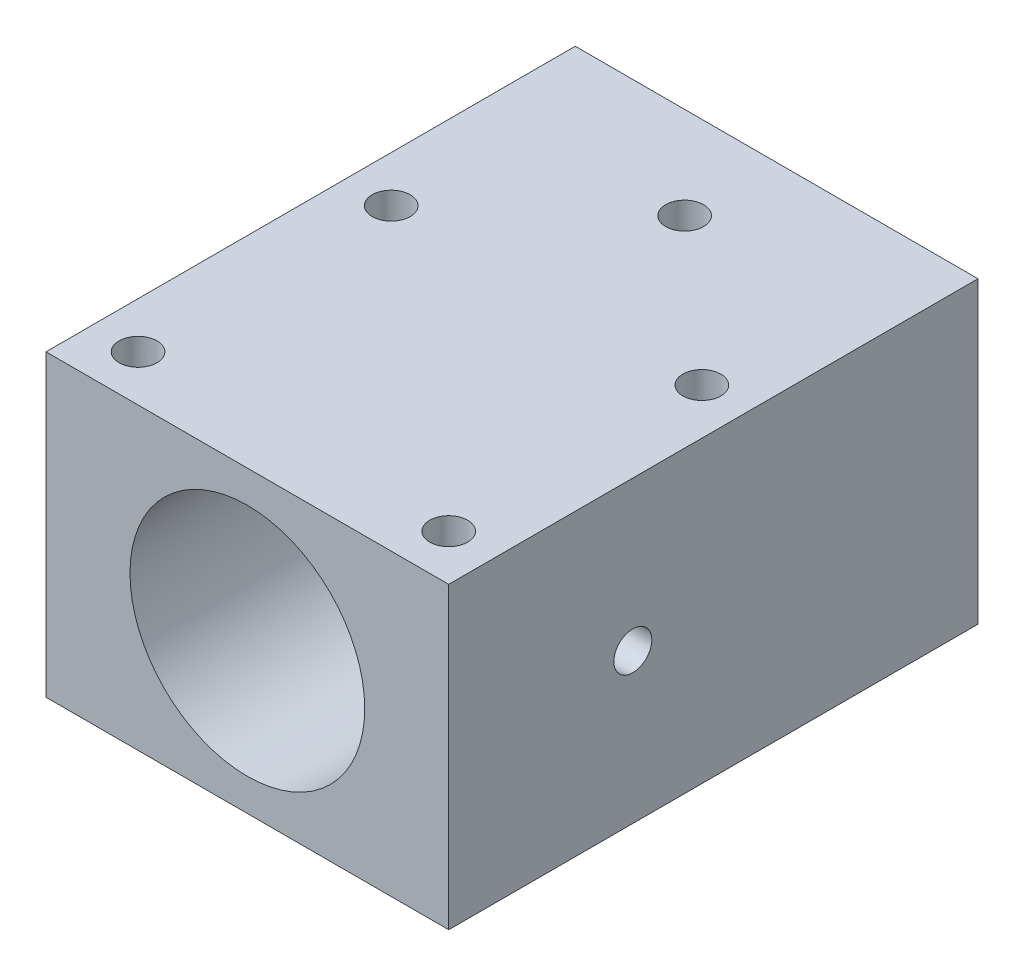
ISO-10303-21;
HEADER;
FILE_DESCRIPTION(('STEP AP214'),'2;1');
FILE_NAME('part.step','',(''),(''),'','','');
FILE_SCHEMA(('AUTOMOTIVE_DESIGN { 1 0 10303 214 1 1 1 1 }'));
ENDSEC;
DATA;
#1=APPLICATION_CONTEXT('core data for automotive mechanical design processes');
#2=APPLICATION_PROTOCOL_DEFINITION('international standard','automotive_design',2000,#1);
#3=PRODUCT_CONTEXT('',#1,'mechanical');
#4=PRODUCT('Part','Part','',(#3));
#5=PRODUCT_RELATED_PRODUCT_CATEGORY('part','',(#4));
#6=PRODUCT_DEFINITION_FORMATION('','',#4);
#7=PRODUCT_DEFINITION_CONTEXT('part definition',#1,'design');
#8=PRODUCT_DEFINITION('design','',#6,#7);
#9=PRODUCT_DEFINITION_SHAPE('','',#8);
#10=(LENGTH_UNIT() NAMED_UNIT(*) SI_UNIT(.MILLI.,.METRE.));
#11=(NAMED_UNIT(*) PLANE_ANGLE_UNIT() SI_UNIT($,.RADIAN.));
#12=(NAMED_UNIT(*) SI_UNIT($,.STERADIAN.) SOLID_ANGLE_UNIT());
#13=UNCERTAINTY_MEASURE_WITH_UNIT(LENGTH_MEASURE(1.E-05),#10,'distance_accuracy_value','');
#14=(GEOMETRIC_REPRESENTATION_CONTEXT(3) GLOBAL_UNCERTAINTY_ASSIGNED_CONTEXT((#13)) GLOBAL_UNIT_ASSIGNED_CONTEXT((#10,
#11,#12)) REPRESENTATION_CONTEXT('',''));
#15=CARTESIAN_POINT('',(0.,0.,0.));
#16=DIRECTION('',(0.,0.,1.));
#17=DIRECTION('',(1.,0.,0.));
#18=AXIS2_PLACEMENT_3D('',#15,#16,#17);
#19=CARTESIAN_POINT('',(17.5,13.,23.));
#20=DIRECTION('',(-1.,0.,0.));
#21=DIRECTION('',(0.,0.,1.));
#22=AXIS2_PLACEMENT_3D('',#19,#20,#21);
#23=PLANE('',#22);
#24=CARTESIAN_POINT('',(17.5,0.,7.));
#25=DIRECTION('',(-1.,0.,0.));
#26=DIRECTION('',(0.,0.,1.));
#27=AXIS2_PLACEMENT_3D('',#24,#25,#26);
#28=CIRCLE('',#27,1.65);
#29=CARTESIAN_POINT('',(17.5,0.,8.65));
#30=VERTEX_POINT('',#29);
#31=EDGE_CURVE('E148',#30,#30,#28,.F.);
#32=ORIENTED_EDGE('',*,*,#31,.F.);
#33=EDGE_LOOP('',(#32));
#34=FACE_BOUND('',#33,.T.);
#35=DIRECTION('',(0.,0.,-1.));
#36=VECTOR('',#35,1.);
#37=CARTESIAN_POINT('',(17.5,-13.,23.));
#38=LINE('',#37,#36);
#39=CARTESIAN_POINT('',(17.5,-13.,23.));
#40=VERTEX_POINT('',#39);
#41=CARTESIAN_POINT('',(17.5,-13.,-23.));
#42=VERTEX_POINT('',#41);
#43=EDGE_CURVE('E107',#40,#42,#38,.T.);
#44=ORIENTED_EDGE('',*,*,#43,.T.);
#45=DIRECTION('',(0.,-1.,0.));
#46=VECTOR('',#45,1.);
#47=CARTESIAN_POINT('',(17.5,13.,-23.));
#48=LINE('',#47,#46);
#49=CARTESIAN_POINT('',(17.5,13.,-23.));
#50=VERTEX_POINT('',#49);
#51=EDGE_CURVE('E11',#50,#42,#48,.T.);
#52=ORIENTED_EDGE('',*,*,#51,.F.);
#53=DIRECTION('',(0.,0.,-1.));
#54=VECTOR('',#53,1.);
#55=CARTESIAN_POINT('',(17.5,13.,23.));
#56=LINE('',#55,#54);
#57=CARTESIAN_POINT('',(17.5,13.,23.));
#58=VERTEX_POINT('',#57);
#59=EDGE_CURVE('E94',#58,#50,#56,.T.);
#60=ORIENTED_EDGE('',*,*,#59,.F.);
#61=DIRECTION('',(0.,-1.,0.));
#62=VECTOR('',#61,1.);
#63=CARTESIAN_POINT('',(17.5,13.,23.));
#64=LINE('',#63,#62);
#65=EDGE_CURVE('E103',#58,#40,#64,.T.);
#66=ORIENTED_EDGE('',*,*,#65,.T.);
#67=EDGE_LOOP('',(#44,#52,#60,#66));
#68=FACE_BOUND('',#67,.T.);
#69=ADVANCED_FACE('F36',(#34,#68),#23,.F.);
#70=CARTESIAN_POINT('',(-17.5,13.,-23.));
#71=DIRECTION('',(0.,0.,1.));
#72=DIRECTION('',(1.,0.,0.));
#73=AXIS2_PLACEMENT_3D('',#70,#71,#72);
#74=PLANE('',#73);
#75=CARTESIAN_POINT('',(0.,0.,-23.));
#76=DIRECTION('',(0.,0.,1.));
#77=DIRECTION('',(1.,0.,0.));
#78=AXIS2_PLACEMENT_3D('',#75,#76,#77);
#79=CIRCLE('',#78,10.2);
#80=CARTESIAN_POINT('',(10.2,0.,-23.));
#81=VERTEX_POINT('',#80);
#82=EDGE_CURVE('E167',#81,#81,#79,.F.);
#83=ORIENTED_EDGE('',*,*,#82,.F.);
#84=EDGE_LOOP('',(#83));
#85=FACE_BOUND('',#84,.T.);
#86=DIRECTION('',(-1.,0.,0.));
#87=VECTOR('',#86,1.);
#88=CARTESIAN_POINT('',(-17.5,-13.,-23.));
#89=LINE('',#88,#87);
#90=CARTESIAN_POINT('',(-17.5,-13.,-23.));
#91=VERTEX_POINT('',#90);
#92=EDGE_CURVE('E98',#42,#91,#89,.T.);
#93=ORIENTED_EDGE('',*,*,#92,.T.);
#94=DIRECTION('',(0.,-1.,0.));
#95=VECTOR('',#94,1.);
#96=CARTESIAN_POINT('',(-17.5,13.,-23.));
#97=LINE('',#96,#95);
#98=CARTESIAN_POINT('',(-17.5,13.,-23.));
#99=VERTEX_POINT('',#98);
#100=EDGE_CURVE('E50',#99,#91,#97,.T.);
#101=ORIENTED_EDGE('',*,*,#100,.F.);
#102=DIRECTION('',(-1.,0.,0.));
#103=VECTOR('',#102,1.);
#104=CARTESIAN_POINT('',(-17.5,13.,-23.));
#105=LINE('',#104,#103);
#106=EDGE_CURVE('E89',#50,#99,#105,.T.);
#107=ORIENTED_EDGE('',*,*,#106,.F.);
#108=ORIENTED_EDGE('',*,*,#51,.T.);
#109=EDGE_LOOP('',(#93,#101,#107,#108));
#110=FACE_BOUND('',#109,.T.);
#111=ADVANCED_FACE('F97',(#85,#110),#74,.F.);
#112=CARTESIAN_POINT('',(-17.5,13.,23.));
#113=DIRECTION('',(1.,0.,0.));
#114=DIRECTION('',(0.,0.,-1.));
#115=AXIS2_PLACEMENT_3D('',#112,#113,#114);
#116=PLANE('',#115);
#117=CARTESIAN_POINT('',(-17.5,0.,7.));
#118=DIRECTION('',(-1.,0.,0.));
#119=DIRECTION('',(0.,0.,1.));
#120=AXIS2_PLACEMENT_3D('',#117,#118,#119);
#121=CIRCLE('',#120,1.65);
#122=CARTESIAN_POINT('',(-17.5,0.,8.65));
#123=VERTEX_POINT('',#122);
#124=EDGE_CURVE('E154',#123,#123,#121,.T.);
#125=ORIENTED_EDGE('',*,*,#124,.F.);
#126=EDGE_LOOP('',(#125));
#127=FACE_BOUND('',#126,.T.);
#128=DIRECTION('',(0.,0.,1.));
#129=VECTOR('',#128,1.);
#130=CARTESIAN_POINT('',(-17.5,-13.,23.));
#131=LINE('',#130,#129);
#132=CARTESIAN_POINT('',(-17.5,-13.,23.));
#133=VERTEX_POINT('',#132);
#134=EDGE_CURVE('E76',#91,#133,#131,.T.);
#135=ORIENTED_EDGE('',*,*,#134,.T.);
#136=DIRECTION('',(0.,-1.,0.));
#137=VECTOR('',#136,1.);
#138=CARTESIAN_POINT('',(-17.5,13.,23.));
#139=LINE('',#138,#137);
#140=CARTESIAN_POINT('',(-17.5,13.,23.));
#141=VERTEX_POINT('',#140);
#142=EDGE_CURVE('E99',#141,#133,#139,.T.);
#143=ORIENTED_EDGE('',*,*,#142,.F.);
#144=DIRECTION('',(0.,0.,1.));
#145=VECTOR('',#144,1.);
#146=CARTESIAN_POINT('',(-17.5,13.,23.));
#147=LINE('',#146,#145);
#148=EDGE_CURVE('E92',#99,#141,#147,.T.);
#149=ORIENTED_EDGE('',*,*,#148,.F.);
#150=ORIENTED_EDGE('',*,*,#100,.T.);
#151=EDGE_LOOP('',(#135,#143,#149,#150));
#152=FACE_BOUND('',#151,.T.);
#153=ADVANCED_FACE('F101',(#127,#152),#116,.F.);
#154=CARTESIAN_POINT('',(-17.5,13.,23.));
#155=DIRECTION('',(0.,0.,-1.));
#156=DIRECTION('',(-1.,0.,0.));
#157=AXIS2_PLACEMENT_3D('',#154,#155,#156);
#158=PLANE('',#157);
#159=CARTESIAN_POINT('',(0.,0.,23.));
#160=DIRECTION('',(0.,0.,1.));
#161=DIRECTION('',(1.,0.,0.));
#162=AXIS2_PLACEMENT_3D('',#159,#160,#161);
#163=CIRCLE('',#162,10.2);
#164=CARTESIAN_POINT('',(10.2,0.,23.));
#165=VERTEX_POINT('',#164);
#166=EDGE_CURVE('E164',#165,#165,#163,.T.);
#167=ORIENTED_EDGE('',*,*,#166,.F.);
#168=EDGE_LOOP('',(#167));
#169=FACE_BOUND('',#168,.T.);
#170=DIRECTION('',(1.,0.,0.));
#171=VECTOR('',#170,1.);
#172=CARTESIAN_POINT('',(-17.5,-13.,23.));
#173=LINE('',#172,#171);
#174=EDGE_CURVE('E82',#133,#40,#173,.T.);
#175=ORIENTED_EDGE('',*,*,#174,.T.);
#176=ORIENTED_EDGE('',*,*,#65,.F.);
#177=DIRECTION('',(1.,0.,0.));
#178=VECTOR('',#177,1.);
#179=CARTESIAN_POINT('',(-17.5,13.,23.));
#180=LINE('',#179,#178);
#181=EDGE_CURVE('E59',#141,#58,#180,.T.);
#182=ORIENTED_EDGE('',*,*,#181,.F.);
#183=ORIENTED_EDGE('',*,*,#142,.T.);
#184=EDGE_LOOP('',(#175,#176,#182,#183));
#185=FACE_BOUND('',#184,.T.);
#186=ADVANCED_FACE('F220',(#169,#185),#158,.F.);
#187=CARTESIAN_POINT('',(0.,13.,0.));
#188=DIRECTION('',(0.,-1.,0.));
#189=DIRECTION('',(0.,0.,-1.));
#190=AXIS2_PLACEMENT_3D('',#187,#188,#189);
#191=PLANE('',#190);
#192=CARTESIAN_POINT('',(0.,13.,-15.));
#193=DIRECTION('',(0.,1.,0.));
#194=DIRECTION('',(0.,0.,1.));
#195=AXIS2_PLACEMENT_3D('',#192,#193,#194);
#196=CIRCLE('',#195,1.65);
#197=CARTESIAN_POINT('',(0.,13.,-13.35));
#198=VERTEX_POINT('',#197);
#199=EDGE_CURVE('E152',#198,#198,#196,.T.);
#200=ORIENTED_EDGE('',*,*,#199,.F.);
#201=EDGE_LOOP('',(#200));
#202=FACE_BOUND('',#201,.T.);
#203=CARTESIAN_POINT('',(13.5,13.,-3.));
#204=DIRECTION('',(0.,1.,0.));
#205=DIRECTION('',(0.,0.,-1.));
#206=AXIS2_PLACEMENT_3D('',#203,#204,#205);
#207=CIRCLE('',#206,1.65);
#208=CARTESIAN_POINT('',(13.5,13.,-4.65));
#209=VERTEX_POINT('',#208);
#210=EDGE_CURVE('E170',#209,#209,#207,.T.);
#211=ORIENTED_EDGE('',*,*,#210,.F.);
#212=EDGE_LOOP('',(#211));
#213=FACE_BOUND('',#212,.T.);
#214=CARTESIAN_POINT('',(13.5,13.,19.));
#215=DIRECTION('',(0.,1.,0.));
#216=DIRECTION('',(0.,0.,-1.));
#217=AXIS2_PLACEMENT_3D('',#214,#215,#216);
#218=CIRCLE('',#217,1.65);
#219=CARTESIAN_POINT('',(13.5,13.,17.35));
#220=VERTEX_POINT('',#219);
#221=EDGE_CURVE('E179',#220,#220,#218,.T.);
#222=ORIENTED_EDGE('',*,*,#221,.F.);
#223=EDGE_LOOP('',(#222));
#224=FACE_BOUND('',#223,.T.);
#225=CARTESIAN_POINT('',(-13.5,13.,19.));
#226=DIRECTION('',(0.,1.,0.));
#227=DIRECTION('',(0.,0.,1.));
#228=AXIS2_PLACEMENT_3D('',#225,#226,#227);
#229=CIRCLE('',#228,1.65);
#230=CARTESIAN_POINT('',(-13.5,13.,20.65));
#231=VERTEX_POINT('',#230);
#232=EDGE_CURVE('E171',#231,#231,#229,.T.);
#233=ORIENTED_EDGE('',*,*,#232,.F.);
#234=EDGE_LOOP('',(#233));
#235=FACE_BOUND('',#234,.T.);
#236=CARTESIAN_POINT('',(-13.5,13.,-3.));
#237=DIRECTION('',(0.,1.,0.));
#238=DIRECTION('',(0.,0.,1.));
#239=AXIS2_PLACEMENT_3D('',#236,#237,#238);
#240=CIRCLE('',#239,1.65);
#241=CARTESIAN_POINT('',(-13.5,13.,-1.35));
#242=VERTEX_POINT('',#241);
#243=EDGE_CURVE('E178',#242,#242,#240,.T.);
#244=ORIENTED_EDGE('',*,*,#243,.F.);
#245=EDGE_LOOP('',(#244));
#246=FACE_BOUND('',#245,.T.);
#247=ORIENTED_EDGE('',*,*,#59,.T.);
#248=ORIENTED_EDGE('',*,*,#106,.T.);
#249=ORIENTED_EDGE('',*,*,#148,.T.);
#250=ORIENTED_EDGE('',*,*,#181,.T.);
#251=EDGE_LOOP('',(#247,#248,#249,#250));
#252=FACE_BOUND('',#251,.T.);
#253=ADVANCED_FACE('F90',(#202,#213,#224,#235,#246,#252),#191,.F.);
#254=CARTESIAN_POINT('',(0.,-13.,0.));
#255=DIRECTION('',(0.,-1.,0.));
#256=DIRECTION('',(0.,0.,-1.));
#257=AXIS2_PLACEMENT_3D('',#254,#255,#256);
#258=PLANE('',#257);
#259=CARTESIAN_POINT('',(0.,-13.,-15.));
#260=DIRECTION('',(0.,-1.,0.));
#261=DIRECTION('',(0.,0.,-1.));
#262=AXIS2_PLACEMENT_3D('',#259,#260,#261);
#263=CIRCLE('',#262,1.65);
#264=CARTESIAN_POINT('',(0.,-13.,-16.65));
#265=VERTEX_POINT('',#264);
#266=EDGE_CURVE('E124',#265,#265,#263,.F.);
#267=ORIENTED_EDGE('',*,*,#266,.T.);
#268=EDGE_LOOP('',(#267));
#269=FACE_BOUND('',#268,.T.);
#270=CARTESIAN_POINT('',(13.5,-13.,-3.));
#271=DIRECTION('',(0.,-1.,0.));
#272=DIRECTION('',(0.,0.,-1.));
#273=AXIS2_PLACEMENT_3D('',#270,#271,#272);
#274=CIRCLE('',#273,1.65);
#275=CARTESIAN_POINT('',(13.5,-13.,-4.65));
#276=VERTEX_POINT('',#275);
#277=EDGE_CURVE('E182',#276,#276,#274,.F.);
#278=ORIENTED_EDGE('',*,*,#277,.T.);
#279=EDGE_LOOP('',(#278));
#280=FACE_BOUND('',#279,.T.);
#281=CARTESIAN_POINT('',(13.5,-13.,19.));
#282=DIRECTION('',(0.,-1.,0.));
#283=DIRECTION('',(0.,0.,-1.));
#284=AXIS2_PLACEMENT_3D('',#281,#282,#283);
#285=CIRCLE('',#284,1.65);
#286=CARTESIAN_POINT('',(13.5,-13.,17.35));
#287=VERTEX_POINT('',#286);
#288=EDGE_CURVE('E175',#287,#287,#285,.F.);
#289=ORIENTED_EDGE('',*,*,#288,.T.);
#290=EDGE_LOOP('',(#289));
#291=FACE_BOUND('',#290,.T.);
#292=CARTESIAN_POINT('',(-13.5,-13.,19.));
#293=DIRECTION('',(0.,-1.,0.));
#294=DIRECTION('',(0.,0.,-1.));
#295=AXIS2_PLACEMENT_3D('',#292,#293,#294);
#296=CIRCLE('',#295,1.65);
#297=CARTESIAN_POINT('',(-13.5,-13.,17.35));
#298=VERTEX_POINT('',#297);
#299=EDGE_CURVE('E174',#298,#298,#296,.F.);
#300=ORIENTED_EDGE('',*,*,#299,.T.);
#301=EDGE_LOOP('',(#300));
#302=FACE_BOUND('',#301,.T.);
#303=CARTESIAN_POINT('',(-13.5,-13.,-3.));
#304=DIRECTION('',(0.,-1.,0.));
#305=DIRECTION('',(0.,0.,-1.));
#306=AXIS2_PLACEMENT_3D('',#303,#304,#305);
#307=CIRCLE('',#306,1.65);
#308=CARTESIAN_POINT('',(-13.5,-13.,-4.65));
#309=VERTEX_POINT('',#308);
#310=EDGE_CURVE('E110',#309,#309,#307,.F.);
#311=ORIENTED_EDGE('',*,*,#310,.T.);
#312=EDGE_LOOP('',(#311));
#313=FACE_BOUND('',#312,.T.);
#314=ORIENTED_EDGE('',*,*,#43,.F.);
#315=ORIENTED_EDGE('',*,*,#174,.F.);
#316=ORIENTED_EDGE('',*,*,#134,.F.);
#317=ORIENTED_EDGE('',*,*,#92,.F.);
#318=EDGE_LOOP('',(#314,#315,#316,#317));
#319=FACE_BOUND('',#318,.T.);
#320=ADVANCED_FACE('F194',(#269,#280,#291,#302,#313,#319),#258,.T.);
#321=CARTESIAN_POINT('',(-13.5,-17.6669047558312,-3.));
#322=DIRECTION('',(0.,1.,0.));
#323=DIRECTION('',(0.,0.,1.));
#324=AXIS2_PLACEMENT_3D('',#321,#322,#323);
#325=CYLINDRICAL_SURFACE('',#324,1.65);
#326=ORIENTED_EDGE('',*,*,#243,.T.);
#327=EDGE_LOOP('',(#326));
#328=FACE_BOUND('',#327,.T.);
#329=ORIENTED_EDGE('',*,*,#310,.F.);
#330=EDGE_LOOP('',(#329));
#331=FACE_BOUND('',#330,.T.);
#332=ADVANCED_FACE('F197',(#328,#331),#325,.F.);
#333=CARTESIAN_POINT('',(-13.5,-17.6669047558312,19.));
#334=DIRECTION('',(0.,1.,0.));
#335=DIRECTION('',(0.,0.,1.));
#336=AXIS2_PLACEMENT_3D('',#333,#334,#335);
#337=CYLINDRICAL_SURFACE('',#336,1.65);
#338=ORIENTED_EDGE('',*,*,#232,.T.);
#339=EDGE_LOOP('',(#338));
#340=FACE_BOUND('',#339,.T.);
#341=ORIENTED_EDGE('',*,*,#299,.F.);
#342=EDGE_LOOP('',(#341));
#343=FACE_BOUND('',#342,.T.);
#344=ADVANCED_FACE('F199',(#340,#343),#337,.F.);
#345=CARTESIAN_POINT('',(13.5,-17.6669047558312,19.));
#346=DIRECTION('',(0.,1.,0.));
#347=DIRECTION('',(0.,0.,1.));
#348=AXIS2_PLACEMENT_3D('',#345,#346,#347);
#349=CYLINDRICAL_SURFACE('',#348,1.65);
#350=ORIENTED_EDGE('',*,*,#221,.T.);
#351=EDGE_LOOP('',(#350));
#352=FACE_BOUND('',#351,.T.);
#353=ORIENTED_EDGE('',*,*,#288,.F.);
#354=EDGE_LOOP('',(#353));
#355=FACE_BOUND('',#354,.T.);
#356=ADVANCED_FACE('F206',(#352,#355),#349,.F.);
#357=CARTESIAN_POINT('',(13.5,-17.6669047558312,-3.));
#358=DIRECTION('',(0.,1.,0.));
#359=DIRECTION('',(0.,0.,1.));
#360=AXIS2_PLACEMENT_3D('',#357,#358,#359);
#361=CYLINDRICAL_SURFACE('',#360,1.65);
#362=ORIENTED_EDGE('',*,*,#210,.T.);
#363=EDGE_LOOP('',(#362));
#364=FACE_BOUND('',#363,.T.);
#365=ORIENTED_EDGE('',*,*,#277,.F.);
#366=EDGE_LOOP('',(#365));
#367=FACE_BOUND('',#366,.T.);
#368=ADVANCED_FACE('F234',(#364,#367),#361,.F.);
#369=CARTESIAN_POINT('',(0.,0.,-51.8499566724111));
#370=DIRECTION('',(0.,0.,1.));
#371=DIRECTION('',(1.,0.,0.));
#372=AXIS2_PLACEMENT_3D('',#369,#370,#371);
#373=CYLINDRICAL_SURFACE('',#372,10.2);
#374=CARTESIAN_POINT('',(10.2,0.,5.35));
#375=CARTESIAN_POINT('',(10.1999984505319,0.0920372027822461,5.35000372400592));
#376=CARTESIAN_POINT('',(10.1987412872918,0.184125604922379,5.35772677884246));
#377=CARTESIAN_POINT('',(10.1938472519465,0.365722291925913,5.38840363050981));
#378=CARTESIAN_POINT('',(10.1902081523264,0.455228079721776,5.41137168428542));
#379=CARTESIAN_POINT('',(10.1809586552154,0.6290057052383,5.47182913888829));
#380=CARTESIAN_POINT('',(10.1753498334175,0.713281663374447,5.50930693499283));
#381=CARTESIAN_POINT('',(10.1627785310549,0.87433750638873,5.59769023552187));
#382=CARTESIAN_POINT('',(10.1558162153908,0.951118302717535,5.64859410447212));
#383=CARTESIAN_POINT('',(10.1412401917908,1.09570892000619,5.76287371273261));
#384=CARTESIAN_POINT('',(10.1336216756894,1.16344125296739,5.82634688976152));
#385=CARTESIAN_POINT('',(10.118628958621,1.28734316283406,5.96375362217504));
#386=CARTESIAN_POINT('',(10.1112547726701,1.34351203016562,6.03768781901427));
#387=CARTESIAN_POINT('',(10.0975390660742,1.44300044512817,6.19444666043754));
#388=CARTESIAN_POINT('',(10.0912037590447,1.48624386589337,6.27732021064559));
#389=CARTESIAN_POINT('',(10.0803495177105,1.55816714678377,6.44927428203497));
#390=CARTESIAN_POINT('',(10.0758304679976,1.58684793227529,6.53835440841721));
#391=CARTESIAN_POINT('',(10.0691680969969,1.62858870534978,6.71937348069179));
#392=CARTESIAN_POINT('',(10.0670044918,1.64178214073883,6.8112808946477));
#393=CARTESIAN_POINT('',(10.0652365576846,1.65258735104149,6.99602854571161));
#394=CARTESIAN_POINT('',(10.0656320581068,1.6502001649825,7.08886872020419));
#395=CARTESIAN_POINT('',(10.068919120079,1.6300207020294,7.27189691735994));
#396=CARTESIAN_POINT('',(10.0717864547684,1.61237794246352,7.36210192302924));
#397=CARTESIAN_POINT('',(10.0796562098459,1.56242261010019,7.53825436838929));
#398=CARTESIAN_POINT('',(10.0846586995772,1.5301095608556,7.62420166970197));
#399=CARTESIAN_POINT('',(10.0962614613054,1.4515781188801,7.78984880950673));
#400=CARTESIAN_POINT('',(10.1028688842778,1.40529726056854,7.86951851231183));
#401=CARTESIAN_POINT('',(10.116931997437,1.30018833505186,8.02001785730267));
#402=CARTESIAN_POINT('',(10.1243877521819,1.2413593126336,8.09084682584764));
#403=CARTESIAN_POINT('',(10.1394140869776,1.11200750163794,8.22251993370345));
#404=CARTESIAN_POINT('',(10.1469849921559,1.04135634719828,8.28323800375607));
#405=CARTESIAN_POINT('',(10.161308095587,0.890800961438644,8.39197565774513));
#406=CARTESIAN_POINT('',(10.1680602891159,0.810896676735032,8.43999516841514));
#407=CARTESIAN_POINT('',(10.1799939668742,0.64398750641814,8.52198255216276));
#408=CARTESIAN_POINT('',(10.1851742534653,0.55697727050486,8.55593971826777));
#409=CARTESIAN_POINT('',(10.1933707119943,0.378386345016634,8.60872375625972));
#410=CARTESIAN_POINT('',(10.1963870543549,0.286806015970244,8.62755181966359));
#411=CARTESIAN_POINT('',(10.199892953529,0.102761578056995,8.6493732856014));
#412=CARTESIAN_POINT('',(10.2004101379192,0.0103185057587185,8.65253983160863));
#413=CARTESIAN_POINT('',(10.1989349766708,-0.173777662405198,8.64340936462401));
#414=CARTESIAN_POINT('',(10.1969427218118,-0.265430786726655,8.63111291101031));
#415=CARTESIAN_POINT('',(10.1906896309452,-0.444813708631672,8.59154950030838));
#416=CARTESIAN_POINT('',(10.1864417258512,-0.532562809977774,8.56436784773675));
#417=CARTESIAN_POINT('',(10.1761518329973,-0.702258456224308,8.49589626515647));
#418=CARTESIAN_POINT('',(10.1701097493943,-0.784204690852662,8.45460558144202));
#419=CARTESIAN_POINT('',(10.1568335472208,-0.940723359254562,8.35868853906855));
#420=CARTESIAN_POINT('',(10.149589879809,-1.0152283751142,8.30395351379925));
#421=CARTESIAN_POINT('',(10.1347439619945,-1.15405735960957,8.18285154516154));
#422=CARTESIAN_POINT('',(10.1271416871708,-1.21838063356985,8.116483808772));
#423=CARTESIAN_POINT('',(10.1123465679177,-1.33565845819168,7.973225525582));
#424=CARTESIAN_POINT('',(10.1051584270572,-1.38849629965215,7.89623887370729));
#425=CARTESIAN_POINT('',(10.092091896959,-1.4804894718899,7.73438083755052));
#426=CARTESIAN_POINT('',(10.0862134679902,-1.51964521774486,7.6495096925615));
#427=CARTESIAN_POINT('',(10.0764668626169,-1.58298622104398,7.47462477366391));
#428=CARTESIAN_POINT('',(10.0725907597155,-1.60723058120924,7.38463286755438));
#429=CARTESIAN_POINT('',(10.0672674233492,-1.64024726889529,7.2017864477235));
#430=CARTESIAN_POINT('',(10.0658199921045,-1.64902085628663,7.10893216772775));
#431=CARTESIAN_POINT('',(10.0655260644789,-1.65081337820914,6.92416153252208));
#432=CARTESIAN_POINT('',(10.0666492508487,-1.64401595269812,6.83224695513988));
#433=CARTESIAN_POINT('',(10.0713037288126,-1.61525540850288,6.65088730401594));
#434=CARTESIAN_POINT('',(10.0748350138744,-1.59329233095707,6.56144222357613));
#435=CARTESIAN_POINT('',(10.083896560409,-1.53489265897167,6.38762548760279));
#436=CARTESIAN_POINT('',(10.0894247622213,-1.49847097361647,6.30324870872193));
#437=CARTESIAN_POINT('',(10.1018593947759,-1.41220662823124,6.14177351066202));
#438=CARTESIAN_POINT('',(10.1087658873379,-1.36236336617608,6.06467541817818));
#439=CARTESIAN_POINT('',(10.123275448706,-1.25001171670265,5.91901670039092));
#440=CARTESIAN_POINT('',(10.130885443091,-1.18736793944347,5.85056118176205));
#441=CARTESIAN_POINT('',(10.1458885359828,-1.0514793079378,5.72507024003189));
#442=CARTESIAN_POINT('',(10.1532815839353,-0.978232006016404,5.66803746097483));
#443=CARTESIAN_POINT('',(10.1670729988923,-0.822653835038163,5.56667583174231));
#444=CARTESIAN_POINT('',(10.1734646213385,-0.740267265284117,5.52243155717797));
#445=CARTESIAN_POINT('',(10.1844672895925,-0.569163287307649,5.44847754704901));
#446=CARTESIAN_POINT('',(10.1890801294317,-0.480452365247395,5.41875315900829));
#447=CARTESIAN_POINT('',(10.1949846791975,-0.326150040318016,5.38122367892324));
#448=CARTESIAN_POINT('',(10.196855492486,-0.261498127764662,5.36953328752728));
#449=CARTESIAN_POINT('',(10.1993636956977,-0.131239478919541,5.35392018109225));
#450=CARTESIAN_POINT('',(10.200001104943,-0.0656327576016446,5.34999734436977));
#451=CARTESIAN_POINT('',(10.2,0.,5.35));
#452=B_SPLINE_CURVE_WITH_KNOTS('',3,(#374,#375,#376,#377,#378,#379,#380,#381,#382,#383,#384,
#385,#386,#387,#388,#389,#390,#391,#392,#393,#394,#395,#396,#397,#398,#399,#400,#401,#402,#403,
#404,#405,#406,#407,#408,#409,#410,#411,#412,#413,#414,#415,#416,#417,#418,#419,#420,#421,#422,
#423,#424,#425,#426,#427,#428,#429,#430,#431,#432,#433,#434,#435,#436,#437,#438,#439,#440,#441,
#442,#443,#444,#445,#446,#447,#448,#449,#450,#451),.UNSPECIFIED.,.T.,.F.,(4,2,2,2,2,2,2,2,2,2,2,
2,2,2,2,2,2,2,2,2,2,2,2,2,2,2,2,2,2,2,2,2,2,2,2,2,2,2,4),(0.,0.27587172552677,0.552001807250524,
0.827911498065129,1.10378759491962,1.38189249442482,1.66001445431717,1.9397435735563,
2.21945491549727,2.49673799012245,2.77400257371575,3.04858014317692,3.32316663073454,
3.59899976807539,3.87485391036415,4.15392490438487,4.43299750851651,4.71228220766831,
4.9915449091455,5.26771325518984,5.54387161105805,5.81846366573485,6.09307039143924,
6.36997426607086,6.64689702504397,6.92651428311031,7.20612305761042,7.48461631068612,
7.7630868834691,8.03829018937775,8.31349274877193,8.5884122653772,8.86334411555846,
9.14135026957064,9.41942070003713,9.6992901168504,9.97887652213076,10.1756068137391,
10.372334023425),.UNSPECIFIED.);
#453=CARTESIAN_POINT('',(10.2,0.,5.35));
#454=VERTEX_POINT('',#453);
#455=EDGE_CURVE('E39',#454,#454,#452,.T.);
#456=ORIENTED_EDGE('',*,*,#455,.T.);
#457=EDGE_LOOP('',(#456));
#458=FACE_BOUND('',#457,.T.);
#459=CARTESIAN_POINT('',(-10.2,0.,8.65));
#460=CARTESIAN_POINT('',(-10.1999984505319,0.0920372027822459,8.64999627599408));
#461=CARTESIAN_POINT('',(-10.1987412872918,0.184125604922379,8.64227322115754));
#462=CARTESIAN_POINT('',(-10.1938472519465,0.365722291925912,8.61159636949019));
#463=CARTESIAN_POINT('',(-10.1902081523264,0.455228079721776,8.58862831571458));
#464=CARTESIAN_POINT('',(-10.1809586552154,0.6290057052383,8.52817086111171));
#465=CARTESIAN_POINT('',(-10.1753498334175,0.713281663374447,8.49069306500716));
#466=CARTESIAN_POINT('',(-10.1627785310549,0.874337506388731,8.40230976447813));
#467=CARTESIAN_POINT('',(-10.1558162153908,0.951118302717535,8.35140589552788));
#468=CARTESIAN_POINT('',(-10.1412401917908,1.0957089200062,8.23712628726739));
#469=CARTESIAN_POINT('',(-10.1336216756894,1.16344125296739,8.17365311023848));
#470=CARTESIAN_POINT('',(-10.118628958621,1.28734316283406,8.03624637782496));
#471=CARTESIAN_POINT('',(-10.1112547726701,1.34351203016562,7.96231218098572));
#472=CARTESIAN_POINT('',(-10.0975390660742,1.44300044512817,7.80555333956245));
#473=CARTESIAN_POINT('',(-10.0912037590447,1.48624386589337,7.72267978935441));
#474=CARTESIAN_POINT('',(-10.0803495177105,1.55816714678378,7.55072571796503));
#475=CARTESIAN_POINT('',(-10.0758304679976,1.58684793227529,7.46164559158278));
#476=CARTESIAN_POINT('',(-10.0691680969969,1.62858870534978,7.28062651930821));
#477=CARTESIAN_POINT('',(-10.0670044918,1.64178214073883,7.1887191053523));
#478=CARTESIAN_POINT('',(-10.0652365576846,1.65258735104149,7.00397145428839));
#479=CARTESIAN_POINT('',(-10.0656320581068,1.6502001649825,6.91113127979581));
#480=CARTESIAN_POINT('',(-10.068919120079,1.6300207020294,6.72810308264006));
#481=CARTESIAN_POINT('',(-10.0717864547684,1.61237794246352,6.63789807697076));
#482=CARTESIAN_POINT('',(-10.0796562098459,1.56242261010019,6.46174563161071));
#483=CARTESIAN_POINT('',(-10.0846586995772,1.5301095608556,6.37579833029803));
#484=CARTESIAN_POINT('',(-10.0962614613054,1.45157811888011,6.21015119049327));
#485=CARTESIAN_POINT('',(-10.1028688842778,1.40529726056854,6.13048148768817));
#486=CARTESIAN_POINT('',(-10.116931997437,1.30018833505187,5.97998214269733));
#487=CARTESIAN_POINT('',(-10.1243877521819,1.24135931263361,5.90915317415236));
#488=CARTESIAN_POINT('',(-10.1394140869776,1.11200750163794,5.77748006629655));
#489=CARTESIAN_POINT('',(-10.1469849921559,1.04135634719828,5.71676199624393));
#490=CARTESIAN_POINT('',(-10.161308095587,0.890800961438645,5.60802434225487));
#491=CARTESIAN_POINT('',(-10.1680602891159,0.810896676735032,5.56000483158486));
#492=CARTESIAN_POINT('',(-10.1799939668742,0.64398750641814,5.47801744783724));
#493=CARTESIAN_POINT('',(-10.1851742534653,0.55697727050486,5.44406028173222));
#494=CARTESIAN_POINT('',(-10.1933707119943,0.378386345016635,5.39127624374028));
#495=CARTESIAN_POINT('',(-10.1963870543549,0.286806015970244,5.37244818033641));
#496=CARTESIAN_POINT('',(-10.199892953529,0.102761578056996,5.3506267143986));
#497=CARTESIAN_POINT('',(-10.2004101379192,0.0103185057587192,5.34746016839137));
#498=CARTESIAN_POINT('',(-10.1989349766708,-0.173777662405197,5.35659063537599));
#499=CARTESIAN_POINT('',(-10.1969427218118,-0.265430786726654,5.36888708898969));
#500=CARTESIAN_POINT('',(-10.1906896309452,-0.444813708631672,5.40845049969162));
#501=CARTESIAN_POINT('',(-10.1864417258512,-0.532562809977773,5.43563215226325));
#502=CARTESIAN_POINT('',(-10.1761518329973,-0.702258456224308,5.50410373484353));
#503=CARTESIAN_POINT('',(-10.1701097493943,-0.784204690852662,5.54539441855798));
#504=CARTESIAN_POINT('',(-10.1568335472208,-0.940723359254562,5.64131146093144));
#505=CARTESIAN_POINT('',(-10.149589879809,-1.01522837511419,5.69604648620074));
#506=CARTESIAN_POINT('',(-10.1347439619945,-1.15405735960956,5.81714845483846));
#507=CARTESIAN_POINT('',(-10.1271416871708,-1.21838063356985,5.883516191228));
#508=CARTESIAN_POINT('',(-10.1123465679177,-1.33565845819168,6.026774474418));
#509=CARTESIAN_POINT('',(-10.1051584270572,-1.38849629965215,6.1037611262927));
#510=CARTESIAN_POINT('',(-10.092091896959,-1.4804894718899,6.26561916244948));
#511=CARTESIAN_POINT('',(-10.0862134679902,-1.51964521774486,6.3504903074385));
#512=CARTESIAN_POINT('',(-10.0764668626169,-1.58298622104398,6.52537522633608));
#513=CARTESIAN_POINT('',(-10.0725907597155,-1.60723058120924,6.61536713244562));
#514=CARTESIAN_POINT('',(-10.0672674233492,-1.64024726889529,6.7982135522765));
#515=CARTESIAN_POINT('',(-10.0658199921045,-1.64902085628663,6.89106783227225));
#516=CARTESIAN_POINT('',(-10.0655260644789,-1.65081337820914,7.07583846747791));
#517=CARTESIAN_POINT('',(-10.0666492508487,-1.64401595269812,7.16775304486012));
#518=CARTESIAN_POINT('',(-10.0713037288126,-1.61525540850288,7.34911269598406));
#519=CARTESIAN_POINT('',(-10.0748350138744,-1.59329233095707,7.43855777642387));
#520=CARTESIAN_POINT('',(-10.083896560409,-1.53489265897167,7.61237451239721));
#521=CARTESIAN_POINT('',(-10.0894247622213,-1.49847097361647,7.69675129127807));
#522=CARTESIAN_POINT('',(-10.1018593947759,-1.41220662823124,7.85822648933798));
#523=CARTESIAN_POINT('',(-10.1087658873379,-1.36236336617608,7.93532458182181));
#524=CARTESIAN_POINT('',(-10.123275448706,-1.25001171670265,8.08098329960907));
#525=CARTESIAN_POINT('',(-10.130885443091,-1.18736793944347,8.14943881823795));
#526=CARTESIAN_POINT('',(-10.1458885359828,-1.0514793079378,8.27492975996811));
#527=CARTESIAN_POINT('',(-10.1532815839353,-0.978232006016404,8.33196253902517));
#528=CARTESIAN_POINT('',(-10.1670729988923,-0.822653835038162,8.43332416825768));
#529=CARTESIAN_POINT('',(-10.1734646213385,-0.740267265284116,8.47756844282203));
#530=CARTESIAN_POINT('',(-10.1844672895925,-0.569163287307648,8.55152245295099));
#531=CARTESIAN_POINT('',(-10.1890801294317,-0.480452365247394,8.5812468409917));
#532=CARTESIAN_POINT('',(-10.1949846791975,-0.326150040318015,8.61877632107676));
#533=CARTESIAN_POINT('',(-10.196855492486,-0.261498127764662,8.63046671247272));
#534=CARTESIAN_POINT('',(-10.1993636956977,-0.131239478919541,8.64607981890775));
#535=CARTESIAN_POINT('',(-10.200001104943,-0.0656327576016442,8.65000265563023));
#536=CARTESIAN_POINT('',(-10.2,0.,8.65));
#537=B_SPLINE_CURVE_WITH_KNOTS('',3,(#459,#460,#461,#462,#463,#464,#465,#466,#467,#468,#469,
#470,#471,#472,#473,#474,#475,#476,#477,#478,#479,#480,#481,#482,#483,#484,#485,#486,#487,#488,
#489,#490,#491,#492,#493,#494,#495,#496,#497,#498,#499,#500,#501,#502,#503,#504,#505,#506,#507,
#508,#509,#510,#511,#512,#513,#514,#515,#516,#517,#518,#519,#520,#521,#522,#523,#524,#525,#526,
#527,#528,#529,#530,#531,#532,#533,#534,#535,#536),.UNSPECIFIED.,.T.,.F.,(4,2,2,2,2,2,2,2,2,2,2,
2,2,2,2,2,2,2,2,2,2,2,2,2,2,2,2,2,2,2,2,2,2,2,2,2,2,2,4),(0.,0.27587172552677,0.552001807250524,
0.82791149806513,1.10378759491962,1.38189249442482,1.66001445431717,1.9397435735563,
2.21945491549727,2.49673799012245,2.77400257371575,3.04858014317692,3.32316663073454,
3.59899976807539,3.87485391036415,4.15392490438487,4.4329975085165,4.7122822076683,
4.9915449091455,5.26771325518984,5.54387161105805,5.81846366573485,6.09307039143924,
6.36997426607086,6.64689702504397,6.92651428311031,7.20612305761042,7.48461631068612,
7.7630868834691,8.03829018937776,8.31349274877193,8.5884122653772,8.86334411555845,
9.14135026957064,9.41942070003713,9.6992901168504,9.97887652213076,10.1756068137391,
10.372334023425),.UNSPECIFIED.);
#538=CARTESIAN_POINT('',(-10.2,0.,8.65));
#539=VERTEX_POINT('',#538);
#540=EDGE_CURVE('E143',#539,#539,#537,.T.);
#541=ORIENTED_EDGE('',*,*,#540,.T.);
#542=EDGE_LOOP('',(#541));
#543=FACE_BOUND('',#542,.T.);
#544=CARTESIAN_POINT('',(0.,-10.2,-13.35));
#545=CARTESIAN_POINT('',(-0.0920372027822458,-10.1999984505319,-13.3500037240059));
#546=CARTESIAN_POINT('',(-0.184125604922379,-10.1987412872918,-13.3577267788425));
#547=CARTESIAN_POINT('',(-0.365722291925912,-10.1938472519465,-13.3884036305098));
#548=CARTESIAN_POINT('',(-0.455228079721775,-10.1902081523264,-13.4113716842854));
#549=CARTESIAN_POINT('',(-0.629005705238299,-10.1809586552154,-13.4718291388883));
#550=CARTESIAN_POINT('',(-0.713281663374446,-10.1753498334175,-13.5093069349928));
#551=CARTESIAN_POINT('',(-0.874337506388729,-10.1627785310549,-13.5976902355219));
#552=CARTESIAN_POINT('',(-0.951118302717534,-10.1558162153908,-13.6485941044721));
#553=CARTESIAN_POINT('',(-1.09570892000619,-10.1412401917908,-13.7628737127326));
#554=CARTESIAN_POINT('',(-1.16344125296739,-10.1336216756894,-13.8263468897615));
#555=CARTESIAN_POINT('',(-1.28734316283406,-10.118628958621,-13.963753622175));
#556=CARTESIAN_POINT('',(-1.34351203016562,-10.1112547726701,-14.0376878190143));
#557=CARTESIAN_POINT('',(-1.44300044512817,-10.0975390660742,-14.1944466604375));
#558=CARTESIAN_POINT('',(-1.48624386589337,-10.0912037590447,-14.2773202106456));
#559=CARTESIAN_POINT('',(-1.55816714678377,-10.0803495177105,-14.449274282035));
#560=CARTESIAN_POINT('',(-1.58684793227529,-10.0758304679976,-14.5383544084172));
#561=CARTESIAN_POINT('',(-1.62858870534978,-10.0691680969969,-14.7193734806918));
#562=CARTESIAN_POINT('',(-1.64178214073883,-10.0670044918,-14.8112808946477));
#563=CARTESIAN_POINT('',(-1.65258735104149,-10.0652365576846,-14.9960285457116));
#564=CARTESIAN_POINT('',(-1.6502001649825,-10.0656320581068,-15.0888687202042));
#565=CARTESIAN_POINT('',(-1.63002070202939,-10.068919120079,-15.2718969173599));
#566=CARTESIAN_POINT('',(-1.61237794246351,-10.0717864547684,-15.3621019230292));
#567=CARTESIAN_POINT('',(-1.56242261010019,-10.0796562098459,-15.5382543683893));
#568=CARTESIAN_POINT('',(-1.53010956085559,-10.0846586995772,-15.624201669702));
#569=CARTESIAN_POINT('',(-1.4515781188801,-10.0962614613054,-15.7898488095067));
#570=CARTESIAN_POINT('',(-1.40529726056854,-10.1028688842778,-15.8695185123118));
#571=CARTESIAN_POINT('',(-1.30018833505187,-10.116931997437,-16.0200178573027));
#572=CARTESIAN_POINT('',(-1.24135931263361,-10.1243877521819,-16.0908468258476));
#573=CARTESIAN_POINT('',(-1.11200750163794,-10.1394140869776,-16.2225199337034));
#574=CARTESIAN_POINT('',(-1.04135634719828,-10.1469849921559,-16.2832380037561));
#575=CARTESIAN_POINT('',(-0.890800961438644,-10.161308095587,-16.3919756577451));
#576=CARTESIAN_POINT('',(-0.810896676735031,-10.1680602891159,-16.4399951684151));
#577=CARTESIAN_POINT('',(-0.643987506418139,-10.1799939668742,-16.5219825521628));
#578=CARTESIAN_POINT('',(-0.556977270504859,-10.1851742534653,-16.5559397182678));
#579=CARTESIAN_POINT('',(-0.378386345016634,-10.1933707119943,-16.6087237562597));
#580=CARTESIAN_POINT('',(-0.286806015970244,-10.1963870543549,-16.6275518196636));
#581=CARTESIAN_POINT('',(-0.102761578056996,-10.199892953529,-16.6493732856014));
#582=CARTESIAN_POINT('',(-0.0103185057587195,-10.2004101379192,-16.6525398316086));
#583=CARTESIAN_POINT('',(0.173777662405197,-10.1989349766708,-16.643409364624));
#584=CARTESIAN_POINT('',(0.265430786726654,-10.1969427218118,-16.6311129110103));
#585=CARTESIAN_POINT('',(0.444813708631671,-10.1906896309452,-16.5915495003084));
#586=CARTESIAN_POINT('',(0.532562809977773,-10.1864417258512,-16.5643678477368));
#587=CARTESIAN_POINT('',(0.702258456224308,-10.1761518329973,-16.4958962651565));
#588=CARTESIAN_POINT('',(0.784204690852661,-10.1701097493943,-16.454605581442));
#589=CARTESIAN_POINT('',(0.940723359254561,-10.1568335472208,-16.3586885390685));
#590=CARTESIAN_POINT('',(1.01522837511419,-10.149589879809,-16.3039535137993));
#591=CARTESIAN_POINT('',(1.15405735960956,-10.1347439619945,-16.1828515451615));
#592=CARTESIAN_POINT('',(1.21838063356984,-10.1271416871708,-16.116483808772));
#593=CARTESIAN_POINT('',(1.33565845819168,-10.1123465679177,-15.973225525582));
#594=CARTESIAN_POINT('',(1.38849629965215,-10.1051584270572,-15.8962388737073));
#595=CARTESIAN_POINT('',(1.4804894718899,-10.092091896959,-15.7343808375505));
#596=CARTESIAN_POINT('',(1.51964521774486,-10.0862134679902,-15.6495096925615));
#597=CARTESIAN_POINT('',(1.58298622104397,-10.0764668626169,-15.4746247736639));
#598=CARTESIAN_POINT('',(1.60723058120924,-10.0725907597155,-15.3846328675544));
#599=CARTESIAN_POINT('',(1.64024726889529,-10.0672674233492,-15.2017864477235));
#600=CARTESIAN_POINT('',(1.64902085628663,-10.0658199921045,-15.1089321677277));
#601=CARTESIAN_POINT('',(1.65081337820913,-10.0655260644789,-14.9241615325221));
#602=CARTESIAN_POINT('',(1.64401595269812,-10.0666492508487,-14.8322469551399));
#603=CARTESIAN_POINT('',(1.61525540850288,-10.0713037288126,-14.6508873040159));
#604=CARTESIAN_POINT('',(1.59329233095707,-10.0748350138744,-14.5614422235761));
#605=CARTESIAN_POINT('',(1.53489265897167,-10.083896560409,-14.3876254876028));
#606=CARTESIAN_POINT('',(1.49847097361647,-10.0894247622213,-14.3032487087219));
#607=CARTESIAN_POINT('',(1.41220662823124,-10.1018593947759,-14.141773510662));
#608=CARTESIAN_POINT('',(1.36236336617608,-10.1087658873379,-14.0646754181782));
#609=CARTESIAN_POINT('',(1.25001171670265,-10.123275448706,-13.9190167003909));
#610=CARTESIAN_POINT('',(1.18736793944347,-10.130885443091,-13.8505611817621));
#611=CARTESIAN_POINT('',(1.0514793079378,-10.1458885359828,-13.7250702400319));
#612=CARTESIAN_POINT('',(0.978232006016402,-10.1532815839353,-13.6680374609748));
#613=CARTESIAN_POINT('',(0.822653835038161,-10.1670729988923,-13.5666758317423));
#614=CARTESIAN_POINT('',(0.740267265284115,-10.1734646213385,-13.522431557178));
#615=CARTESIAN_POINT('',(0.569163287307647,-10.1844672895925,-13.448477547049));
#616=CARTESIAN_POINT('',(0.480452365247393,-10.1890801294317,-13.4187531590083));
#617=CARTESIAN_POINT('',(0.326150040318015,-10.1949846791975,-13.3812236789232));
#618=CARTESIAN_POINT('',(0.261498127764662,-10.196855492486,-13.3695332875273));
#619=CARTESIAN_POINT('',(0.131239478919541,-10.1993636956977,-13.3539201810923));
#620=CARTESIAN_POINT('',(0.0656327576016446,-10.200001104943,-13.3499973443698));
#621=CARTESIAN_POINT('',(0.,-10.2,-13.35));
#622=B_SPLINE_CURVE_WITH_KNOTS('',3,(#544,#545,#546,#547,#548,#549,#550,#551,#552,#553,#554,
#555,#556,#557,#558,#559,#560,#561,#562,#563,#564,#565,#566,#567,#568,#569,#570,#571,#572,#573,
#574,#575,#576,#577,#578,#579,#580,#581,#582,#583,#584,#585,#586,#587,#588,#589,#590,#591,#592,
#593,#594,#595,#596,#597,#598,#599,#600,#601,#602,#603,#604,#605,#606,#607,#608,#609,#610,#611,
#612,#613,#614,#615,#616,#617,#618,#619,#620,#621),.UNSPECIFIED.,.T.,.F.,(4,2,2,2,2,2,2,2,2,2,2,
2,2,2,2,2,2,2,2,2,2,2,2,2,2,2,2,2,2,2,2,2,2,2,2,2,2,2,4),(0.,0.27587172552677,0.552001807250524,
0.827911498065129,1.10378759491962,1.38189249442481,1.66001445431717,1.9397435735563,
2.21945491549727,2.49673799012245,2.77400257371575,3.04858014317691,3.32316663073453,
3.59899976807537,3.87485391036414,4.15392490438486,4.4329975085165,4.7122822076683,
4.99154490914549,5.26771325518983,5.54387161105805,5.81846366573484,6.09307039143923,
6.36997426607086,6.64689702504396,6.9265142831103,7.20612305761041,7.48461631068611,
7.76308688346909,8.03829018937775,8.31349274877192,8.58841226537719,8.86334411555845,
9.14135026957063,9.41942070003712,9.69929011685039,9.97887652213075,10.1756068137391,
10.372334023425),.UNSPECIFIED.);
#623=CARTESIAN_POINT('',(0.,-10.2,-13.35));
#624=VERTEX_POINT('',#623);
#625=EDGE_CURVE('E123',#624,#624,#622,.T.);
#626=ORIENTED_EDGE('',*,*,#625,.T.);
#627=EDGE_LOOP('',(#626));
#628=FACE_BOUND('',#627,.T.);
#629=CARTESIAN_POINT('',(0.,10.2,-13.35));
#630=CARTESIAN_POINT('',(0.0920372027822458,10.1999984505319,-13.3500037240059));
#631=CARTESIAN_POINT('',(0.184125604922379,10.1987412872918,-13.3577267788425));
#632=CARTESIAN_POINT('',(0.365722291925912,10.1938472519465,-13.3884036305098));
#633=CARTESIAN_POINT('',(0.455228079721775,10.1902081523264,-13.4113716842854));
#634=CARTESIAN_POINT('',(0.629005705238299,10.1809586552154,-13.4718291388883));
#635=CARTESIAN_POINT('',(0.713281663374446,10.1753498334175,-13.5093069349928));
#636=CARTESIAN_POINT('',(0.874337506388729,10.1627785310549,-13.5976902355219));
#637=CARTESIAN_POINT('',(0.951118302717534,10.1558162153908,-13.6485941044721));
#638=CARTESIAN_POINT('',(1.09570892000619,10.1412401917908,-13.7628737127326));
#639=CARTESIAN_POINT('',(1.16344125296739,10.1336216756894,-13.8263468897615));
#640=CARTESIAN_POINT('',(1.28734316283406,10.118628958621,-13.963753622175));
#641=CARTESIAN_POINT('',(1.34351203016562,10.1112547726701,-14.0376878190143));
#642=CARTESIAN_POINT('',(1.44300044512817,10.0975390660742,-14.1944466604375));
#643=CARTESIAN_POINT('',(1.48624386589337,10.0912037590447,-14.2773202106456));
#644=CARTESIAN_POINT('',(1.55816714678377,10.0803495177105,-14.449274282035));
#645=CARTESIAN_POINT('',(1.58684793227529,10.0758304679976,-14.5383544084172));
#646=CARTESIAN_POINT('',(1.62858870534978,10.0691680969969,-14.7193734806918));
#647=CARTESIAN_POINT('',(1.64178214073883,10.0670044918,-14.8112808946477));
#648=CARTESIAN_POINT('',(1.65258735104149,10.0652365576846,-14.9960285457116));
#649=CARTESIAN_POINT('',(1.6502001649825,10.0656320581068,-15.0888687202042));
#650=CARTESIAN_POINT('',(1.63002070202939,10.068919120079,-15.2718969173599));
#651=CARTESIAN_POINT('',(1.61237794246351,10.0717864547684,-15.3621019230292));
#652=CARTESIAN_POINT('',(1.56242261010019,10.0796562098459,-15.5382543683893));
#653=CARTESIAN_POINT('',(1.53010956085559,10.0846586995772,-15.624201669702));
#654=CARTESIAN_POINT('',(1.4515781188801,10.0962614613054,-15.7898488095067));
#655=CARTESIAN_POINT('',(1.40529726056854,10.1028688842778,-15.8695185123118));
#656=CARTESIAN_POINT('',(1.30018833505187,10.116931997437,-16.0200178573027));
#657=CARTESIAN_POINT('',(1.24135931263361,10.1243877521819,-16.0908468258476));
#658=CARTESIAN_POINT('',(1.11200750163794,10.1394140869776,-16.2225199337034));
#659=CARTESIAN_POINT('',(1.04135634719828,10.1469849921559,-16.2832380037561));
#660=CARTESIAN_POINT('',(0.890800961438644,10.161308095587,-16.3919756577451));
#661=CARTESIAN_POINT('',(0.810896676735031,10.1680602891159,-16.4399951684151));
#662=CARTESIAN_POINT('',(0.643987506418139,10.1799939668742,-16.5219825521628));
#663=CARTESIAN_POINT('',(0.556977270504859,10.1851742534653,-16.5559397182678));
#664=CARTESIAN_POINT('',(0.378386345016634,10.1933707119943,-16.6087237562597));
#665=CARTESIAN_POINT('',(0.286806015970244,10.1963870543549,-16.6275518196636));
#666=CARTESIAN_POINT('',(0.102761578056996,10.199892953529,-16.6493732856014));
#667=CARTESIAN_POINT('',(0.0103185057587195,10.2004101379192,-16.6525398316086));
#668=CARTESIAN_POINT('',(-0.173777662405197,10.1989349766708,-16.643409364624));
#669=CARTESIAN_POINT('',(-0.265430786726654,10.1969427218118,-16.6311129110103));
#670=CARTESIAN_POINT('',(-0.444813708631671,10.1906896309452,-16.5915495003084));
#671=CARTESIAN_POINT('',(-0.532562809977773,10.1864417258512,-16.5643678477368));
#672=CARTESIAN_POINT('',(-0.702258456224308,10.1761518329973,-16.4958962651565));
#673=CARTESIAN_POINT('',(-0.784204690852661,10.1701097493943,-16.454605581442));
#674=CARTESIAN_POINT('',(-0.940723359254561,10.1568335472208,-16.3586885390685));
#675=CARTESIAN_POINT('',(-1.01522837511419,10.149589879809,-16.3039535137993));
#676=CARTESIAN_POINT('',(-1.15405735960956,10.1347439619945,-16.1828515451615));
#677=CARTESIAN_POINT('',(-1.21838063356984,10.1271416871708,-16.116483808772));
#678=CARTESIAN_POINT('',(-1.33565845819168,10.1123465679177,-15.973225525582));
#679=CARTESIAN_POINT('',(-1.38849629965215,10.1051584270572,-15.8962388737073));
#680=CARTESIAN_POINT('',(-1.4804894718899,10.092091896959,-15.7343808375505));
#681=CARTESIAN_POINT('',(-1.51964521774486,10.0862134679902,-15.6495096925615));
#682=CARTESIAN_POINT('',(-1.58298622104397,10.0764668626169,-15.4746247736639));
#683=CARTESIAN_POINT('',(-1.60723058120924,10.0725907597155,-15.3846328675544));
#684=CARTESIAN_POINT('',(-1.64024726889529,10.0672674233492,-15.2017864477235));
#685=CARTESIAN_POINT('',(-1.64902085628663,10.0658199921045,-15.1089321677277));
#686=CARTESIAN_POINT('',(-1.65081337820913,10.0655260644789,-14.9241615325221));
#687=CARTESIAN_POINT('',(-1.64401595269812,10.0666492508487,-14.8322469551399));
#688=CARTESIAN_POINT('',(-1.61525540850288,10.0713037288126,-14.6508873040159));
#689=CARTESIAN_POINT('',(-1.59329233095707,10.0748350138744,-14.5614422235761));
#690=CARTESIAN_POINT('',(-1.53489265897167,10.083896560409,-14.3876254876028));
#691=CARTESIAN_POINT('',(-1.49847097361647,10.0894247622213,-14.3032487087219));
#692=CARTESIAN_POINT('',(-1.41220662823124,10.1018593947759,-14.141773510662));
#693=CARTESIAN_POINT('',(-1.36236336617608,10.1087658873379,-14.0646754181782));
#694=CARTESIAN_POINT('',(-1.25001171670265,10.123275448706,-13.9190167003909));
#695=CARTESIAN_POINT('',(-1.18736793944347,10.130885443091,-13.8505611817621));
#696=CARTESIAN_POINT('',(-1.0514793079378,10.1458885359828,-13.7250702400319));
#697=CARTESIAN_POINT('',(-0.978232006016402,10.1532815839353,-13.6680374609748));
#698=CARTESIAN_POINT('',(-0.822653835038161,10.1670729988923,-13.5666758317423));
#699=CARTESIAN_POINT('',(-0.740267265284115,10.1734646213385,-13.522431557178));
#700=CARTESIAN_POINT('',(-0.569163287307647,10.1844672895925,-13.448477547049));
#701=CARTESIAN_POINT('',(-0.480452365247393,10.1890801294317,-13.4187531590083));
#702=CARTESIAN_POINT('',(-0.326150040318015,10.1949846791975,-13.3812236789232));
#703=CARTESIAN_POINT('',(-0.261498127764662,10.196855492486,-13.3695332875273));
#704=CARTESIAN_POINT('',(-0.131239478919541,10.1993636956977,-13.3539201810923));
#705=CARTESIAN_POINT('',(-0.0656327576016446,10.200001104943,-13.3499973443698));
#706=CARTESIAN_POINT('',(0.,10.2,-13.35));
#707=B_SPLINE_CURVE_WITH_KNOTS('',3,(#629,#630,#631,#632,#633,#634,#635,#636,#637,#638,#639,
#640,#641,#642,#643,#644,#645,#646,#647,#648,#649,#650,#651,#652,#653,#654,#655,#656,#657,#658,
#659,#660,#661,#662,#663,#664,#665,#666,#667,#668,#669,#670,#671,#672,#673,#674,#675,#676,#677,
#678,#679,#680,#681,#682,#683,#684,#685,#686,#687,#688,#689,#690,#691,#692,#693,#694,#695,#696,
#697,#698,#699,#700,#701,#702,#703,#704,#705,#706),.UNSPECIFIED.,.T.,.F.,(4,2,2,2,2,2,2,2,2,2,2,
2,2,2,2,2,2,2,2,2,2,2,2,2,2,2,2,2,2,2,2,2,2,2,2,2,2,2,4),(0.,0.27587172552677,0.552001807250524,
0.827911498065129,1.10378759491962,1.38189249442481,1.66001445431717,1.9397435735563,
2.21945491549727,2.49673799012245,2.77400257371575,3.04858014317691,3.32316663073453,
3.59899976807537,3.87485391036414,4.15392490438486,4.4329975085165,4.7122822076683,
4.99154490914549,5.26771325518983,5.54387161105805,5.81846366573484,6.09307039143923,
6.36997426607086,6.64689702504396,6.9265142831103,7.20612305761041,7.48461631068611,
7.76308688346909,8.03829018937775,8.31349274877192,8.58841226537719,8.86334411555845,
9.14135026957063,9.41942070003712,9.69929011685039,9.97887652213075,10.1756068137391,
10.372334023425),.UNSPECIFIED.);
#708=CARTESIAN_POINT('',(0.,10.2,-13.35));
#709=VERTEX_POINT('',#708);
#710=EDGE_CURVE('E116',#709,#709,#707,.T.);
#711=ORIENTED_EDGE('',*,*,#710,.T.);
#712=EDGE_LOOP('',(#711));
#713=FACE_BOUND('',#712,.T.);
#714=ORIENTED_EDGE('',*,*,#82,.T.);
#715=EDGE_LOOP('',(#714));
#716=FACE_BOUND('',#715,.T.);
#717=ORIENTED_EDGE('',*,*,#166,.T.);
#718=EDGE_LOOP('',(#717));
#719=FACE_BOUND('',#718,.T.);
#720=ADVANCED_FACE('F128',(#458,#543,#628,#713,#716,#719),#373,.F.);
#721=CARTESIAN_POINT('',(0.,-17.6669047558312,-15.));
#722=DIRECTION('',(0.,1.,0.));
#723=DIRECTION('',(0.,0.,1.));
#724=AXIS2_PLACEMENT_3D('',#721,#722,#723);
#725=CYLINDRICAL_SURFACE('',#724,1.65);
#726=ORIENTED_EDGE('',*,*,#199,.T.);
#727=EDGE_LOOP('',(#726));
#728=FACE_BOUND('',#727,.T.);
#729=ORIENTED_EDGE('',*,*,#710,.F.);
#730=EDGE_LOOP('',(#729));
#731=FACE_BOUND('',#730,.T.);
#732=ADVANCED_FACE('F135',(#728,#731),#725,.F.);
#733=ORIENTED_EDGE('',*,*,#266,.F.);
#734=EDGE_LOOP('',(#733));
#735=FACE_BOUND('',#734,.T.);
#736=ORIENTED_EDGE('',*,*,#625,.F.);
#737=EDGE_LOOP('',(#736));
#738=FACE_BOUND('',#737,.T.);
#739=ADVANCED_FACE('F131',(#735,#738),#725,.F.);
#740=CARTESIAN_POINT('',(22.1669047558312,0.,7.));
#741=DIRECTION('',(-1.,0.,0.));
#742=DIRECTION('',(0.,0.,1.));
#743=AXIS2_PLACEMENT_3D('',#740,#741,#742);
#744=CYLINDRICAL_SURFACE('',#743,1.65);
#745=ORIENTED_EDGE('',*,*,#124,.T.);
#746=EDGE_LOOP('',(#745));
#747=FACE_BOUND('',#746,.T.);
#748=ORIENTED_EDGE('',*,*,#540,.F.);
#749=EDGE_LOOP('',(#748));
#750=FACE_BOUND('',#749,.T.);
#751=ADVANCED_FACE('F134',(#747,#750),#744,.F.);
#752=ORIENTED_EDGE('',*,*,#31,.T.);
#753=EDGE_LOOP('',(#752));
#754=FACE_BOUND('',#753,.T.);
#755=ORIENTED_EDGE('',*,*,#455,.F.);
#756=EDGE_LOOP('',(#755));
#757=FACE_BOUND('',#756,.T.);
#758=ADVANCED_FACE('F137',(#754,#757),#744,.F.);
#759=CLOSED_SHELL('',(#69,#111,#153,#186,#253,#320,#332,#344,#356,#368,#720,#732,#739,#751,#758));
#760=MANIFOLD_SOLID_BREP('B2',#759);
#761=ADVANCED_BREP_SHAPE_REPRESENTATION('',(#18,#760),#14);
#762=SHAPE_DEFINITION_REPRESENTATION(#9,#761);
ENDSEC;
END-ISO-10303-21;
